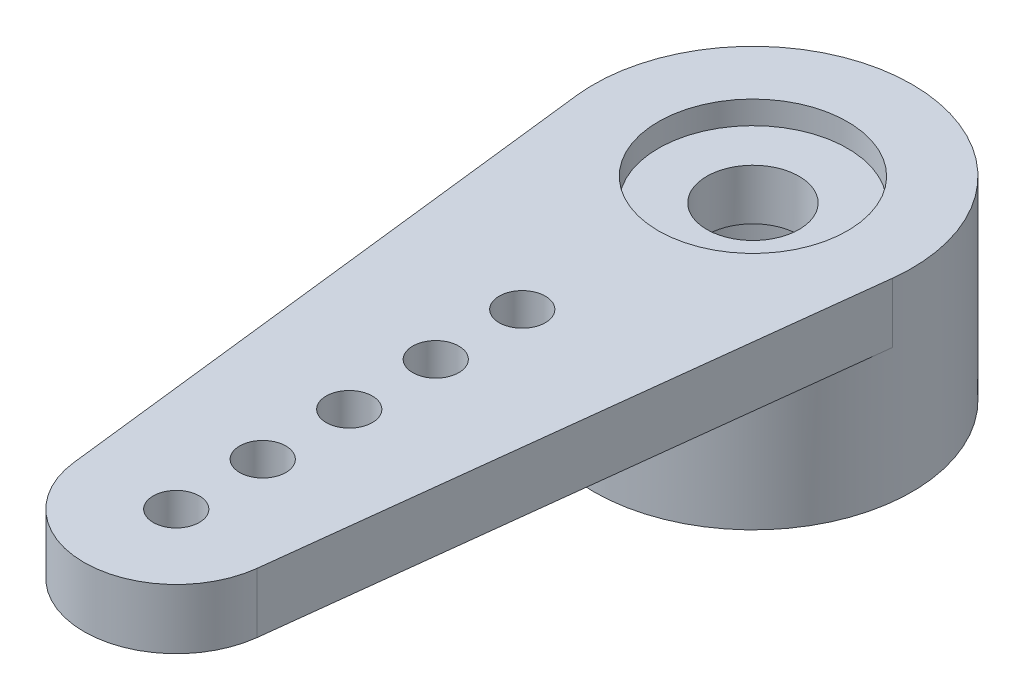
ISO-10303-21;
HEADER;
FILE_DESCRIPTION(('STEP AP214'),'2;1');
FILE_NAME('part.step','',(''),(''),'','','');
FILE_SCHEMA(('AUTOMOTIVE_DESIGN { 1 0 10303 214 1 1 1 1 }'));
ENDSEC;
DATA;
#1=APPLICATION_CONTEXT('core data for automotive mechanical design processes');
#2=APPLICATION_PROTOCOL_DEFINITION('international standard','automotive_design',2000,#1);
#3=PRODUCT_CONTEXT('',#1,'mechanical');
#4=PRODUCT('Part','Part','',(#3));
#5=PRODUCT_RELATED_PRODUCT_CATEGORY('part','',(#4));
#6=PRODUCT_DEFINITION_FORMATION('','',#4);
#7=PRODUCT_DEFINITION_CONTEXT('part definition',#1,'design');
#8=PRODUCT_DEFINITION('design','',#6,#7);
#9=PRODUCT_DEFINITION_SHAPE('','',#8);
#10=(LENGTH_UNIT() NAMED_UNIT(*) SI_UNIT(.MILLI.,.METRE.));
#11=(NAMED_UNIT(*) PLANE_ANGLE_UNIT() SI_UNIT($,.RADIAN.));
#12=(NAMED_UNIT(*) SI_UNIT($,.STERADIAN.) SOLID_ANGLE_UNIT());
#13=UNCERTAINTY_MEASURE_WITH_UNIT(LENGTH_MEASURE(1.E-05),#10,'distance_accuracy_value','');
#14=(GEOMETRIC_REPRESENTATION_CONTEXT(3) GLOBAL_UNCERTAINTY_ASSIGNED_CONTEXT((#13)) GLOBAL_UNIT_ASSIGNED_CONTEXT((#10,
#11,#12)) REPRESENTATION_CONTEXT('',''));
#15=CARTESIAN_POINT('',(0.,0.,0.));
#16=DIRECTION('',(0.,0.,1.));
#17=DIRECTION('',(1.,0.,0.));
#18=AXIS2_PLACEMENT_3D('',#15,#16,#17);
#19=CARTESIAN_POINT('',(0.,0.,0.));
#20=DIRECTION('',(0.,1.,0.));
#21=DIRECTION('',(0.,0.,1.));
#22=AXIS2_PLACEMENT_3D('',#19,#20,#21);
#23=CYLINDRICAL_SURFACE('',#22,1.);
#24=CARTESIAN_POINT('',(0.,3.7,0.));
#25=DIRECTION('',(0.,1.,0.));
#26=DIRECTION('',(0.,0.,1.));
#27=AXIS2_PLACEMENT_3D('',#24,#25,#26);
#28=CIRCLE('',#27,1.);
#29=CARTESIAN_POINT('',(0.,3.7,1.));
#30=VERTEX_POINT('',#29);
#31=EDGE_CURVE('E136',#30,#30,#28,.T.);
#32=ORIENTED_EDGE('',*,*,#31,.T.);
#33=EDGE_LOOP('',(#32));
#34=FACE_BOUND('',#33,.T.);
#35=CARTESIAN_POINT('',(0.,2.6,0.));
#36=DIRECTION('',(0.,-1.,0.));
#37=DIRECTION('',(0.,0.,-1.));
#38=AXIS2_PLACEMENT_3D('',#35,#36,#37);
#39=CIRCLE('',#38,1.);
#40=CARTESIAN_POINT('',(0.,2.6,-1.));
#41=VERTEX_POINT('',#40);
#42=EDGE_CURVE('E36',#41,#41,#39,.F.);
#43=ORIENTED_EDGE('',*,*,#42,.F.);
#44=EDGE_LOOP('',(#43));
#45=FACE_BOUND('',#44,.T.);
#46=ADVANCED_FACE('F32',(#34,#45),#23,.F.);
#47=CARTESIAN_POINT('',(0.,4.2,0.));
#48=DIRECTION('',(0.,-1.,0.));
#49=DIRECTION('',(0.,0.,-1.));
#50=AXIS2_PLACEMENT_3D('',#47,#48,#49);
#51=CYLINDRICAL_SURFACE('',#50,3.45);
#52=CARTESIAN_POINT('',(0.,2.9,0.));
#53=DIRECTION('',(0.,-1.,0.));
#54=DIRECTION('',(0.,0.,-1.));
#55=AXIS2_PLACEMENT_3D('',#52,#53,#54);
#56=CIRCLE('',#55,3.45);
#57=CARTESIAN_POINT('',(3.42670978636943,2.9,0.4002));
#58=VERTEX_POINT('',#57);
#59=CARTESIAN_POINT('',(-3.42670978636943,2.9,0.4002));
#60=VERTEX_POINT('',#59);
#61=EDGE_CURVE('E11',#58,#60,#56,.T.);
#62=ORIENTED_EDGE('',*,*,#61,.T.);
#63=DIRECTION('',(0.,1.,0.));
#64=VECTOR('',#63,1.);
#65=CARTESIAN_POINT('',(-3.42670978636943,2.9,0.4002));
#66=LINE('',#65,#64);
#67=CARTESIAN_POINT('',(-3.42670978636943,4.2,0.4002));
#68=VERTEX_POINT('',#67);
#69=EDGE_CURVE('E80',#60,#68,#66,.T.);
#70=ORIENTED_EDGE('',*,*,#69,.T.);
#71=CARTESIAN_POINT('',(0.,4.2,0.));
#72=DIRECTION('',(0.,1.,0.));
#73=DIRECTION('',(0.,0.,1.));
#74=AXIS2_PLACEMENT_3D('',#71,#72,#73);
#75=CIRCLE('',#74,3.45);
#76=CARTESIAN_POINT('',(3.42670978636943,4.2,0.4002));
#77=VERTEX_POINT('',#76);
#78=EDGE_CURVE('E41',#77,#68,#75,.T.);
#79=ORIENTED_EDGE('',*,*,#78,.F.);
#80=DIRECTION('',(0.,1.,0.));
#81=VECTOR('',#80,1.);
#82=CARTESIAN_POINT('',(3.42670978636943,2.9,0.4002));
#83=LINE('',#82,#81);
#84=EDGE_CURVE('E105',#58,#77,#83,.T.);
#85=ORIENTED_EDGE('',*,*,#84,.F.);
#86=EDGE_LOOP('',(#62,#70,#79,#85));
#87=FACE_BOUND('',#86,.T.);
#88=CARTESIAN_POINT('',(0.,0.,0.));
#89=DIRECTION('',(0.,1.,0.));
#90=DIRECTION('',(0.,0.,1.));
#91=AXIS2_PLACEMENT_3D('',#88,#89,#90);
#92=CIRCLE('',#91,3.45);
#93=CARTESIAN_POINT('',(0.,0.,3.45));
#94=VERTEX_POINT('',#93);
#95=EDGE_CURVE('E107',#94,#94,#92,.T.);
#96=ORIENTED_EDGE('',*,*,#95,.T.);
#97=EDGE_LOOP('',(#96));
#98=FACE_BOUND('',#97,.T.);
#99=ADVANCED_FACE('F34',(#87,#98),#51,.T.);
#100=CARTESIAN_POINT('',(0.,4.2,0.));
#101=DIRECTION('',(0.,1.,0.));
#102=DIRECTION('',(0.,0.,1.));
#103=AXIS2_PLACEMENT_3D('',#100,#101,#102);
#104=PLANE('',#103);
#105=CARTESIAN_POINT('',(0.,4.2,5.));
#106=DIRECTION('',(0.,1.,0.));
#107=DIRECTION('',(0.,0.,1.));
#108=AXIS2_PLACEMENT_3D('',#105,#106,#107);
#109=CIRCLE('',#108,0.5);
#110=CARTESIAN_POINT('',(0.,4.2,5.5));
#111=VERTEX_POINT('',#110);
#112=EDGE_CURVE('E130',#111,#111,#109,.T.);
#113=ORIENTED_EDGE('',*,*,#112,.F.);
#114=EDGE_LOOP('',(#113));
#115=FACE_BOUND('',#114,.T.);
#116=CARTESIAN_POINT('',(0.,4.2,6.875));
#117=DIRECTION('',(0.,1.,0.));
#118=DIRECTION('',(0.,0.,1.));
#119=AXIS2_PLACEMENT_3D('',#116,#117,#118);
#120=CIRCLE('',#119,0.5);
#121=CARTESIAN_POINT('',(0.,4.2,7.375));
#122=VERTEX_POINT('',#121);
#123=EDGE_CURVE('E127',#122,#122,#120,.T.);
#124=ORIENTED_EDGE('',*,*,#123,.F.);
#125=EDGE_LOOP('',(#124));
#126=FACE_BOUND('',#125,.T.);
#127=CARTESIAN_POINT('',(0.,4.2,8.75));
#128=DIRECTION('',(0.,1.,0.));
#129=DIRECTION('',(0.,0.,1.));
#130=AXIS2_PLACEMENT_3D('',#127,#128,#129);
#131=CIRCLE('',#130,0.5);
#132=CARTESIAN_POINT('',(0.,4.2,9.25));
#133=VERTEX_POINT('',#132);
#134=EDGE_CURVE('E124',#133,#133,#131,.T.);
#135=ORIENTED_EDGE('',*,*,#134,.F.);
#136=EDGE_LOOP('',(#135));
#137=FACE_BOUND('',#136,.T.);
#138=CARTESIAN_POINT('',(0.,4.2,10.625));
#139=DIRECTION('',(0.,1.,0.));
#140=DIRECTION('',(0.,0.,1.));
#141=AXIS2_PLACEMENT_3D('',#138,#139,#140);
#142=CIRCLE('',#141,0.5);
#143=CARTESIAN_POINT('',(0.,4.2,11.125));
#144=VERTEX_POINT('',#143);
#145=EDGE_CURVE('E120',#144,#144,#142,.T.);
#146=ORIENTED_EDGE('',*,*,#145,.F.);
#147=EDGE_LOOP('',(#146));
#148=FACE_BOUND('',#147,.T.);
#149=CARTESIAN_POINT('',(0.,4.2,12.5));
#150=DIRECTION('',(0.,1.,0.));
#151=DIRECTION('',(0.,0.,1.));
#152=AXIS2_PLACEMENT_3D('',#149,#150,#151);
#153=CIRCLE('',#152,0.5);
#154=CARTESIAN_POINT('',(0.,4.2,13.));
#155=VERTEX_POINT('',#154);
#156=EDGE_CURVE('E116',#155,#155,#153,.T.);
#157=ORIENTED_EDGE('',*,*,#156,.F.);
#158=EDGE_LOOP('',(#157));
#159=FACE_BOUND('',#158,.T.);
#160=CARTESIAN_POINT('',(0.,4.2,0.));
#161=DIRECTION('',(0.,1.,0.));
#162=DIRECTION('',(0.,0.,1.));
#163=AXIS2_PLACEMENT_3D('',#160,#161,#162);
#164=CIRCLE('',#163,2.05);
#165=CARTESIAN_POINT('',(0.,4.2,2.05));
#166=VERTEX_POINT('',#165);
#167=EDGE_CURVE('E97',#166,#166,#164,.T.);
#168=ORIENTED_EDGE('',*,*,#167,.F.);
#169=EDGE_LOOP('',(#168));
#170=FACE_BOUND('',#169,.T.);
#171=ORIENTED_EDGE('',*,*,#78,.T.);
#172=DIRECTION('',(0.116,0.,0.993249213440414));
#173=VECTOR('',#172,1.);
#174=CARTESIAN_POINT('',(-3.42670978636943,4.2,0.4002));
#175=LINE('',#174,#173);
#176=CARTESIAN_POINT('',(-1.98649842688083,4.2,12.732));
#177=VERTEX_POINT('',#176);
#178=EDGE_CURVE('E101',#68,#177,#175,.T.);
#179=ORIENTED_EDGE('',*,*,#178,.T.);
#180=CARTESIAN_POINT('',(0.,4.2,12.5));
#181=DIRECTION('',(0.,1.,0.));
#182=DIRECTION('',(0.,0.,1.));
#183=AXIS2_PLACEMENT_3D('',#180,#181,#182);
#184=CIRCLE('',#183,2.);
#185=CARTESIAN_POINT('',(1.98649842688083,4.2,12.732));
#186=VERTEX_POINT('',#185);
#187=EDGE_CURVE('E86',#177,#186,#184,.T.);
#188=ORIENTED_EDGE('',*,*,#187,.T.);
#189=DIRECTION('',(0.116,0.,-0.993249213440414));
#190=VECTOR('',#189,1.);
#191=CARTESIAN_POINT('',(1.98649842688083,4.2,12.732));
#192=LINE('',#191,#190);
#193=EDGE_CURVE('E49',#186,#77,#192,.T.);
#194=ORIENTED_EDGE('',*,*,#193,.T.);
#195=EDGE_LOOP('',(#171,#179,#188,#194));
#196=FACE_BOUND('',#195,.T.);
#197=ADVANCED_FACE('F157',(#115,#126,#137,#148,#159,#170,#196),#104,.T.);
#198=CARTESIAN_POINT('',(0.,0.,0.));
#199=DIRECTION('',(0.,1.,0.));
#200=DIRECTION('',(0.,0.,1.));
#201=AXIS2_PLACEMENT_3D('',#198,#199,#200);
#202=PLANE('',#201);
#203=CARTESIAN_POINT('',(0.,0.,0.));
#204=DIRECTION('',(0.,-1.,0.));
#205=DIRECTION('',(0.,0.,-1.));
#206=AXIS2_PLACEMENT_3D('',#203,#204,#205);
#207=CIRCLE('',#206,2.5);
#208=CARTESIAN_POINT('',(0.,0.,-2.5));
#209=VERTEX_POINT('',#208);
#210=EDGE_CURVE('E227',#209,#209,#207,.T.);
#211=ORIENTED_EDGE('',*,*,#210,.F.);
#212=EDGE_LOOP('',(#211));
#213=FACE_BOUND('',#212,.T.);
#214=ORIENTED_EDGE('',*,*,#95,.F.);
#215=EDGE_LOOP('',(#214));
#216=FACE_BOUND('',#215,.T.);
#217=ADVANCED_FACE('F159',(#213,#216),#202,.F.);
#218=CARTESIAN_POINT('',(0.,2.9,0.));
#219=DIRECTION('',(0.,-1.,0.));
#220=DIRECTION('',(0.,0.,-1.));
#221=AXIS2_PLACEMENT_3D('',#218,#219,#220);
#222=PLANE('',#221);
#223=CARTESIAN_POINT('',(0.,2.9,5.));
#224=DIRECTION('',(0.,-1.,0.));
#225=DIRECTION('',(0.,0.,-1.));
#226=AXIS2_PLACEMENT_3D('',#223,#224,#225);
#227=CIRCLE('',#226,0.5);
#228=CARTESIAN_POINT('',(0.,2.9,4.5));
#229=VERTEX_POINT('',#228);
#230=EDGE_CURVE('E128',#229,#229,#227,.T.);
#231=ORIENTED_EDGE('',*,*,#230,.F.);
#232=EDGE_LOOP('',(#231));
#233=FACE_BOUND('',#232,.T.);
#234=CARTESIAN_POINT('',(0.,2.9,6.875));
#235=DIRECTION('',(0.,-1.,0.));
#236=DIRECTION('',(0.,0.,-1.));
#237=AXIS2_PLACEMENT_3D('',#234,#235,#236);
#238=CIRCLE('',#237,0.5);
#239=CARTESIAN_POINT('',(0.,2.9,6.375));
#240=VERTEX_POINT('',#239);
#241=EDGE_CURVE('E125',#240,#240,#238,.T.);
#242=ORIENTED_EDGE('',*,*,#241,.F.);
#243=EDGE_LOOP('',(#242));
#244=FACE_BOUND('',#243,.T.);
#245=CARTESIAN_POINT('',(0.,2.9,8.75));
#246=DIRECTION('',(0.,-1.,0.));
#247=DIRECTION('',(0.,0.,-1.));
#248=AXIS2_PLACEMENT_3D('',#245,#246,#247);
#249=CIRCLE('',#248,0.5);
#250=CARTESIAN_POINT('',(0.,2.9,8.25));
#251=VERTEX_POINT('',#250);
#252=EDGE_CURVE('E121',#251,#251,#249,.T.);
#253=ORIENTED_EDGE('',*,*,#252,.F.);
#254=EDGE_LOOP('',(#253));
#255=FACE_BOUND('',#254,.T.);
#256=CARTESIAN_POINT('',(0.,2.9,10.625));
#257=DIRECTION('',(0.,-1.,0.));
#258=DIRECTION('',(0.,0.,-1.));
#259=AXIS2_PLACEMENT_3D('',#256,#257,#258);
#260=CIRCLE('',#259,0.5);
#261=CARTESIAN_POINT('',(0.,2.9,10.125));
#262=VERTEX_POINT('',#261);
#263=EDGE_CURVE('E117',#262,#262,#260,.T.);
#264=ORIENTED_EDGE('',*,*,#263,.F.);
#265=EDGE_LOOP('',(#264));
#266=FACE_BOUND('',#265,.T.);
#267=CARTESIAN_POINT('',(0.,2.9,12.5));
#268=DIRECTION('',(0.,-1.,0.));
#269=DIRECTION('',(0.,0.,-1.));
#270=AXIS2_PLACEMENT_3D('',#267,#268,#269);
#271=CIRCLE('',#270,0.5);
#272=CARTESIAN_POINT('',(0.,2.9,12.));
#273=VERTEX_POINT('',#272);
#274=EDGE_CURVE('E113',#273,#273,#271,.T.);
#275=ORIENTED_EDGE('',*,*,#274,.F.);
#276=EDGE_LOOP('',(#275));
#277=FACE_BOUND('',#276,.T.);
#278=ORIENTED_EDGE('',*,*,#61,.F.);
#279=DIRECTION('',(0.116,0.,-0.993249213440414));
#280=VECTOR('',#279,1.);
#281=CARTESIAN_POINT('',(1.98649842688083,2.9,12.732));
#282=LINE('',#281,#280);
#283=CARTESIAN_POINT('',(1.98649842688083,2.9,12.732));
#284=VERTEX_POINT('',#283);
#285=EDGE_CURVE('E91',#284,#58,#282,.T.);
#286=ORIENTED_EDGE('',*,*,#285,.F.);
#287=CARTESIAN_POINT('',(0.,2.9,12.5));
#288=DIRECTION('',(0.,1.,0.));
#289=DIRECTION('',(0.,0.,1.));
#290=AXIS2_PLACEMENT_3D('',#287,#288,#289);
#291=CIRCLE('',#290,2.);
#292=CARTESIAN_POINT('',(-1.98649842688083,2.9,12.732));
#293=VERTEX_POINT('',#292);
#294=EDGE_CURVE('E85',#293,#284,#291,.T.);
#295=ORIENTED_EDGE('',*,*,#294,.F.);
#296=DIRECTION('',(0.116,0.,0.993249213440414));
#297=VECTOR('',#296,1.);
#298=CARTESIAN_POINT('',(-3.42670978636943,2.9,0.4002));
#299=LINE('',#298,#297);
#300=EDGE_CURVE('E90',#60,#293,#299,.T.);
#301=ORIENTED_EDGE('',*,*,#300,.F.);
#302=EDGE_LOOP('',(#278,#286,#295,#301));
#303=FACE_BOUND('',#302,.T.);
#304=ADVANCED_FACE('F89',(#233,#244,#255,#266,#277,#303),#222,.T.);
#305=CARTESIAN_POINT('',(1.98649842688083,2.9,12.732));
#306=DIRECTION('',(0.993249213440413,0.,0.116));
#307=DIRECTION('',(0.116,0.,-0.993249213440414));
#308=AXIS2_PLACEMENT_3D('',#305,#306,#307);
#309=PLANE('',#308);
#310=ORIENTED_EDGE('',*,*,#193,.F.);
#311=DIRECTION('',(0.,1.,0.));
#312=VECTOR('',#311,1.);
#313=CARTESIAN_POINT('',(1.98649842688083,2.9,12.732));
#314=LINE('',#313,#312);
#315=EDGE_CURVE('E74',#284,#186,#314,.T.);
#316=ORIENTED_EDGE('',*,*,#315,.F.);
#317=ORIENTED_EDGE('',*,*,#285,.T.);
#318=ORIENTED_EDGE('',*,*,#84,.T.);
#319=EDGE_LOOP('',(#310,#316,#317,#318));
#320=FACE_BOUND('',#319,.T.);
#321=ADVANCED_FACE('F167',(#320),#309,.T.);
#322=CARTESIAN_POINT('',(0.,2.9,12.5));
#323=DIRECTION('',(0.,1.,0.));
#324=DIRECTION('',(0.,0.,1.));
#325=AXIS2_PLACEMENT_3D('',#322,#323,#324);
#326=CYLINDRICAL_SURFACE('',#325,2.);
#327=ORIENTED_EDGE('',*,*,#187,.F.);
#328=DIRECTION('',(0.,1.,0.));
#329=VECTOR('',#328,1.);
#330=CARTESIAN_POINT('',(-1.98649842688083,2.9,12.732));
#331=LINE('',#330,#329);
#332=EDGE_CURVE('E82',#293,#177,#331,.T.);
#333=ORIENTED_EDGE('',*,*,#332,.F.);
#334=ORIENTED_EDGE('',*,*,#294,.T.);
#335=ORIENTED_EDGE('',*,*,#315,.T.);
#336=EDGE_LOOP('',(#327,#333,#334,#335));
#337=FACE_BOUND('',#336,.T.);
#338=ADVANCED_FACE('F84',(#337),#326,.T.);
#339=CARTESIAN_POINT('',(-3.42670978636943,2.9,0.4002));
#340=DIRECTION('',(-0.993249213440413,0.,0.116));
#341=DIRECTION('',(0.116,0.,0.993249213440414));
#342=AXIS2_PLACEMENT_3D('',#339,#340,#341);
#343=PLANE('',#342);
#344=ORIENTED_EDGE('',*,*,#178,.F.);
#345=ORIENTED_EDGE('',*,*,#69,.F.);
#346=ORIENTED_EDGE('',*,*,#300,.T.);
#347=ORIENTED_EDGE('',*,*,#332,.T.);
#348=EDGE_LOOP('',(#344,#345,#346,#347));
#349=FACE_BOUND('',#348,.T.);
#350=ADVANCED_FACE('F93',(#349),#343,.T.);
#351=CARTESIAN_POINT('',(0.,3.7,0.));
#352=DIRECTION('',(0.,1.,0.));
#353=DIRECTION('',(0.,0.,1.));
#354=AXIS2_PLACEMENT_3D('',#351,#352,#353);
#355=CYLINDRICAL_SURFACE('',#354,2.05);
#356=CARTESIAN_POINT('',(0.,3.7,0.));
#357=DIRECTION('',(0.,1.,0.));
#358=DIRECTION('',(0.,0.,1.));
#359=AXIS2_PLACEMENT_3D('',#356,#357,#358);
#360=CIRCLE('',#359,2.05);
#361=CARTESIAN_POINT('',(0.,3.7,2.05));
#362=VERTEX_POINT('',#361);
#363=EDGE_CURVE('E103',#362,#362,#360,.T.);
#364=ORIENTED_EDGE('',*,*,#363,.F.);
#365=EDGE_LOOP('',(#364));
#366=FACE_BOUND('',#365,.T.);
#367=ORIENTED_EDGE('',*,*,#167,.T.);
#368=EDGE_LOOP('',(#367));
#369=FACE_BOUND('',#368,.T.);
#370=ADVANCED_FACE('F155',(#366,#369),#355,.F.);
#371=CARTESIAN_POINT('',(0.,3.7,0.));
#372=DIRECTION('',(0.,1.,0.));
#373=DIRECTION('',(0.,0.,1.));
#374=AXIS2_PLACEMENT_3D('',#371,#372,#373);
#375=PLANE('',#374);
#376=ORIENTED_EDGE('',*,*,#31,.F.);
#377=EDGE_LOOP('',(#376));
#378=FACE_BOUND('',#377,.T.);
#379=ORIENTED_EDGE('',*,*,#363,.T.);
#380=EDGE_LOOP('',(#379));
#381=FACE_BOUND('',#380,.T.);
#382=ADVANCED_FACE('F207',(#378,#381),#375,.T.);
#383=CARTESIAN_POINT('',(0.,0.,12.5));
#384=DIRECTION('',(0.,1.,0.));
#385=DIRECTION('',(0.,0.,1.));
#386=AXIS2_PLACEMENT_3D('',#383,#384,#385);
#387=CYLINDRICAL_SURFACE('',#386,0.5);
#388=ORIENTED_EDGE('',*,*,#274,.T.);
#389=EDGE_LOOP('',(#388));
#390=FACE_BOUND('',#389,.T.);
#391=ORIENTED_EDGE('',*,*,#156,.T.);
#392=EDGE_LOOP('',(#391));
#393=FACE_BOUND('',#392,.T.);
#394=ADVANCED_FACE('F203',(#390,#393),#387,.F.);
#395=CARTESIAN_POINT('',(0.,0.,10.625));
#396=DIRECTION('',(0.,1.,0.));
#397=DIRECTION('',(0.,0.,1.));
#398=AXIS2_PLACEMENT_3D('',#395,#396,#397);
#399=CYLINDRICAL_SURFACE('',#398,0.5);
#400=ORIENTED_EDGE('',*,*,#263,.T.);
#401=EDGE_LOOP('',(#400));
#402=FACE_BOUND('',#401,.T.);
#403=ORIENTED_EDGE('',*,*,#145,.T.);
#404=EDGE_LOOP('',(#403));
#405=FACE_BOUND('',#404,.T.);
#406=ADVANCED_FACE('F199',(#402,#405),#399,.F.);
#407=CARTESIAN_POINT('',(0.,0.,8.75));
#408=DIRECTION('',(0.,1.,0.));
#409=DIRECTION('',(0.,0.,1.));
#410=AXIS2_PLACEMENT_3D('',#407,#408,#409);
#411=CYLINDRICAL_SURFACE('',#410,0.5);
#412=ORIENTED_EDGE('',*,*,#252,.T.);
#413=EDGE_LOOP('',(#412));
#414=FACE_BOUND('',#413,.T.);
#415=ORIENTED_EDGE('',*,*,#134,.T.);
#416=EDGE_LOOP('',(#415));
#417=FACE_BOUND('',#416,.T.);
#418=ADVANCED_FACE('F195',(#414,#417),#411,.F.);
#419=CARTESIAN_POINT('',(0.,0.,6.875));
#420=DIRECTION('',(0.,1.,0.));
#421=DIRECTION('',(0.,0.,1.));
#422=AXIS2_PLACEMENT_3D('',#419,#420,#421);
#423=CYLINDRICAL_SURFACE('',#422,0.5);
#424=ORIENTED_EDGE('',*,*,#241,.T.);
#425=EDGE_LOOP('',(#424));
#426=FACE_BOUND('',#425,.T.);
#427=ORIENTED_EDGE('',*,*,#123,.T.);
#428=EDGE_LOOP('',(#427));
#429=FACE_BOUND('',#428,.T.);
#430=ADVANCED_FACE('F192',(#426,#429),#423,.F.);
#431=CARTESIAN_POINT('',(0.,0.,5.));
#432=DIRECTION('',(0.,1.,0.));
#433=DIRECTION('',(0.,0.,1.));
#434=AXIS2_PLACEMENT_3D('',#431,#432,#433);
#435=CYLINDRICAL_SURFACE('',#434,0.5);
#436=ORIENTED_EDGE('',*,*,#230,.T.);
#437=EDGE_LOOP('',(#436));
#438=FACE_BOUND('',#437,.T.);
#439=ORIENTED_EDGE('',*,*,#112,.T.);
#440=EDGE_LOOP('',(#439));
#441=FACE_BOUND('',#440,.T.);
#442=ADVANCED_FACE('F188',(#438,#441),#435,.F.);
#443=CARTESIAN_POINT('',(0.,2.6,0.));
#444=DIRECTION('',(0.,-1.,0.));
#445=DIRECTION('',(0.,0.,-1.));
#446=AXIS2_PLACEMENT_3D('',#443,#444,#445);
#447=PLANE('',#446);
#448=CARTESIAN_POINT('',(0.,2.6,0.));
#449=DIRECTION('',(0.,-1.,0.));
#450=DIRECTION('',(0.,0.,-1.));
#451=AXIS2_PLACEMENT_3D('',#448,#449,#450);
#452=CIRCLE('',#451,2.5);
#453=CARTESIAN_POINT('',(0.,2.6,-2.5));
#454=VERTEX_POINT('',#453);
#455=EDGE_CURVE('E230',#454,#454,#452,.T.);
#456=ORIENTED_EDGE('',*,*,#455,.T.);
#457=EDGE_LOOP('',(#456));
#458=FACE_BOUND('',#457,.T.);
#459=ORIENTED_EDGE('',*,*,#42,.T.);
#460=EDGE_LOOP('',(#459));
#461=FACE_BOUND('',#460,.T.);
#462=ADVANCED_FACE('F191',(#458,#461),#447,.T.);
#463=CARTESIAN_POINT('',(0.,2.6,0.));
#464=DIRECTION('',(0.,-1.,0.));
#465=DIRECTION('',(0.,0.,-1.));
#466=AXIS2_PLACEMENT_3D('',#463,#464,#465);
#467=CYLINDRICAL_SURFACE('',#466,2.5);
#468=ORIENTED_EDGE('',*,*,#455,.F.);
#469=EDGE_LOOP('',(#468));
#470=FACE_BOUND('',#469,.T.);
#471=ORIENTED_EDGE('',*,*,#210,.T.);
#472=EDGE_LOOP('',(#471));
#473=FACE_BOUND('',#472,.T.);
#474=ADVANCED_FACE('F186',(#470,#473),#467,.F.);
#475=CLOSED_SHELL('',(#46,#99,#197,#217,#304,#321,#338,#350,#370,#382,#394,#406,#418,#430,#442,
#462,#474));
#476=MANIFOLD_SOLID_BREP('B2',#475);
#477=ADVANCED_BREP_SHAPE_REPRESENTATION('',(#18,#476),#14);
#478=SHAPE_DEFINITION_REPRESENTATION(#9,#477);
ENDSEC;
END-ISO-10303-21;
